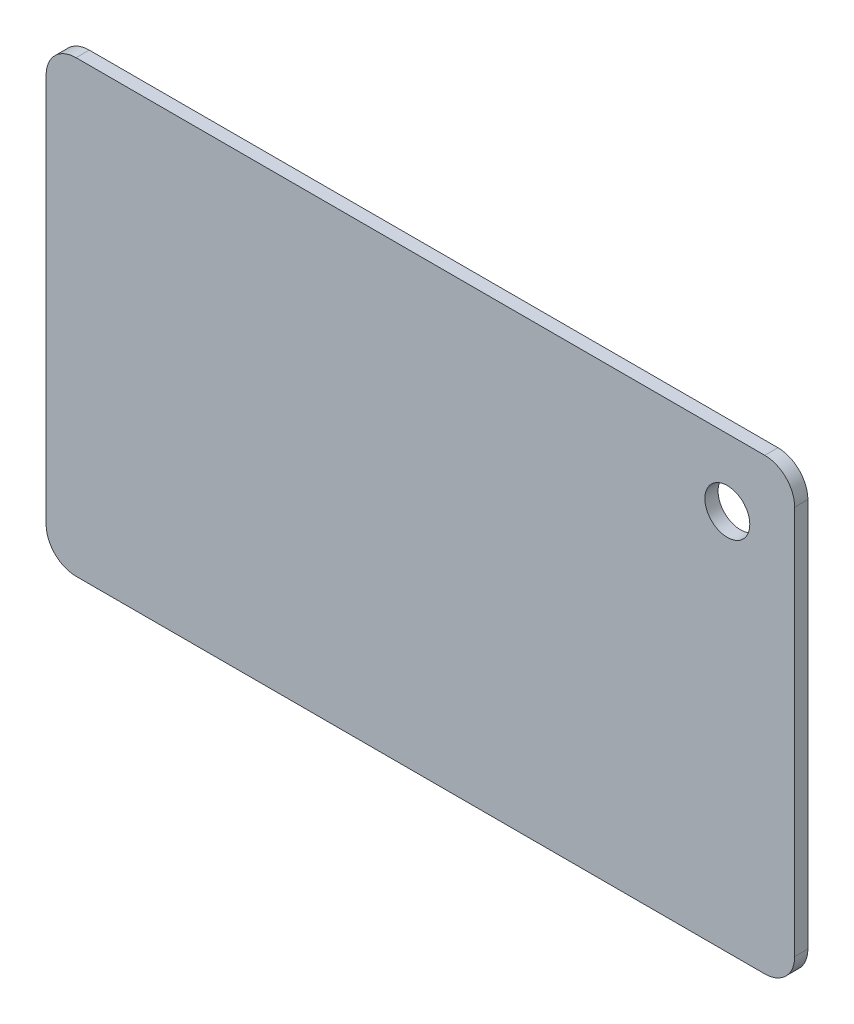
ISO-10303-21;
HEADER;
FILE_DESCRIPTION(('STEP AP214'),'2;1');
FILE_NAME('part.step','',(''),(''),'','','');
FILE_SCHEMA(('AUTOMOTIVE_DESIGN { 1 0 10303 214 1 1 1 1 }'));
ENDSEC;
DATA;
#1=APPLICATION_CONTEXT('core data for automotive mechanical design processes');
#2=APPLICATION_PROTOCOL_DEFINITION('international standard','automotive_design',2000,#1);
#3=PRODUCT_CONTEXT('',#1,'mechanical');
#4=PRODUCT('Part','Part','',(#3));
#5=PRODUCT_RELATED_PRODUCT_CATEGORY('part','',(#4));
#6=PRODUCT_DEFINITION_FORMATION('','',#4);
#7=PRODUCT_DEFINITION_CONTEXT('part definition',#1,'design');
#8=PRODUCT_DEFINITION('design','',#6,#7);
#9=PRODUCT_DEFINITION_SHAPE('','',#8);
#10=(LENGTH_UNIT() NAMED_UNIT(*) SI_UNIT(.MILLI.,.METRE.));
#11=(NAMED_UNIT(*) PLANE_ANGLE_UNIT() SI_UNIT($,.RADIAN.));
#12=(NAMED_UNIT(*) SI_UNIT($,.STERADIAN.) SOLID_ANGLE_UNIT());
#13=UNCERTAINTY_MEASURE_WITH_UNIT(LENGTH_MEASURE(1.E-05),#10,'distance_accuracy_value','');
#14=(GEOMETRIC_REPRESENTATION_CONTEXT(3) GLOBAL_UNCERTAINTY_ASSIGNED_CONTEXT((#13)) GLOBAL_UNIT_ASSIGNED_CONTEXT((#10,
#11,#12)) REPRESENTATION_CONTEXT('',''));
#15=CARTESIAN_POINT('',(0.,0.,0.));
#16=DIRECTION('',(0.,0.,1.));
#17=DIRECTION('',(1.,0.,0.));
#18=AXIS2_PLACEMENT_3D('',#15,#16,#17);
#19=CARTESIAN_POINT('',(23.,13.,0.88));
#20=DIRECTION('',(0.,0.,-1.));
#21=DIRECTION('',(-1.,0.,0.));
#22=AXIS2_PLACEMENT_3D('',#19,#20,#21);
#23=PLANE('',#22);
#24=CARTESIAN_POINT('',(23.,13.,0.88));
#25=DIRECTION('',(0.,0.,1.));
#26=DIRECTION('',(-1.,0.,0.));
#27=AXIS2_PLACEMENT_3D('',#24,#25,#26);
#28=CIRCLE('',#27,2.);
#29=CARTESIAN_POINT('',(25.,13.,0.88));
#30=VERTEX_POINT('',#29);
#31=CARTESIAN_POINT('',(23.,15.,0.88));
#32=VERTEX_POINT('',#31);
#33=EDGE_CURVE('E145',#30,#32,#28,.T.);
#34=ORIENTED_EDGE('',*,*,#33,.T.);
#35=DIRECTION('',(-1.,0.,0.));
#36=VECTOR('',#35,1.);
#37=CARTESIAN_POINT('',(23.,15.,0.88));
#38=LINE('',#37,#36);
#39=CARTESIAN_POINT('',(-23.,15.,0.88));
#40=VERTEX_POINT('',#39);
#41=EDGE_CURVE('E93',#32,#40,#38,.T.);
#42=ORIENTED_EDGE('',*,*,#41,.T.);
#43=CARTESIAN_POINT('',(-23.,13.,0.88));
#44=DIRECTION('',(0.,0.,1.));
#45=DIRECTION('',(1.,0.,0.));
#46=AXIS2_PLACEMENT_3D('',#43,#44,#45);
#47=CIRCLE('',#46,2.);
#48=CARTESIAN_POINT('',(-25.,13.,0.88));
#49=VERTEX_POINT('',#48);
#50=EDGE_CURVE('E160',#40,#49,#47,.T.);
#51=ORIENTED_EDGE('',*,*,#50,.T.);
#52=DIRECTION('',(0.,-1.,0.));
#53=VECTOR('',#52,1.);
#54=CARTESIAN_POINT('',(-25.,13.,0.88));
#55=LINE('',#54,#53);
#56=CARTESIAN_POINT('',(-25.,-13.,0.88));
#57=VERTEX_POINT('',#56);
#58=EDGE_CURVE('E173',#49,#57,#55,.T.);
#59=ORIENTED_EDGE('',*,*,#58,.T.);
#60=CARTESIAN_POINT('',(-23.,-13.,0.88));
#61=DIRECTION('',(0.,0.,1.));
#62=DIRECTION('',(-1.,0.,0.));
#63=AXIS2_PLACEMENT_3D('',#60,#61,#62);
#64=CIRCLE('',#63,2.);
#65=CARTESIAN_POINT('',(-23.,-15.,0.88));
#66=VERTEX_POINT('',#65);
#67=EDGE_CURVE('E112',#57,#66,#64,.T.);
#68=ORIENTED_EDGE('',*,*,#67,.T.);
#69=DIRECTION('',(1.,0.,0.));
#70=VECTOR('',#69,1.);
#71=CARTESIAN_POINT('',(23.,-15.,0.88));
#72=LINE('',#71,#70);
#73=CARTESIAN_POINT('',(23.,-15.,0.88));
#74=VERTEX_POINT('',#73);
#75=EDGE_CURVE('E106',#66,#74,#72,.T.);
#76=ORIENTED_EDGE('',*,*,#75,.T.);
#77=CARTESIAN_POINT('',(23.,-13.,0.88));
#78=DIRECTION('',(0.,0.,1.));
#79=DIRECTION('',(-1.,0.,0.));
#80=AXIS2_PLACEMENT_3D('',#77,#78,#79);
#81=CIRCLE('',#80,2.);
#82=CARTESIAN_POINT('',(25.,-13.,0.88));
#83=VERTEX_POINT('',#82);
#84=EDGE_CURVE('E110',#74,#83,#81,.T.);
#85=ORIENTED_EDGE('',*,*,#84,.T.);
#86=DIRECTION('',(0.,1.,0.));
#87=VECTOR('',#86,1.);
#88=CARTESIAN_POINT('',(25.,13.,0.88));
#89=LINE('',#88,#87);
#90=EDGE_CURVE('E50',#83,#30,#89,.T.);
#91=ORIENTED_EDGE('',*,*,#90,.T.);
#92=EDGE_LOOP('',(#34,#42,#51,#59,#68,#76,#85,#91));
#93=FACE_BOUND('',#92,.T.);
#94=CARTESIAN_POINT('',(20.5,10.5,0.88));
#95=DIRECTION('',(0.,0.,1.));
#96=DIRECTION('',(1.,0.,0.));
#97=AXIS2_PLACEMENT_3D('',#94,#95,#96);
#98=CIRCLE('',#97,1.5);
#99=CARTESIAN_POINT('',(22.,10.5,0.88));
#100=VERTEX_POINT('',#99);
#101=EDGE_CURVE('E134',#100,#100,#98,.T.);
#102=ORIENTED_EDGE('',*,*,#101,.F.);
#103=EDGE_LOOP('',(#102));
#104=FACE_BOUND('',#103,.T.);
#105=ADVANCED_FACE('F33',(#93,#104),#23,.F.);
#106=CARTESIAN_POINT('',(23.,13.,0.));
#107=DIRECTION('',(0.,0.,-1.));
#108=DIRECTION('',(-1.,0.,0.));
#109=AXIS2_PLACEMENT_3D('',#106,#107,#108);
#110=PLANE('',#109);
#111=CARTESIAN_POINT('',(23.,13.,0.));
#112=DIRECTION('',(0.,0.,1.));
#113=DIRECTION('',(-1.,0.,0.));
#114=AXIS2_PLACEMENT_3D('',#111,#112,#113);
#115=CIRCLE('',#114,2.);
#116=CARTESIAN_POINT('',(25.,13.,0.));
#117=VERTEX_POINT('',#116);
#118=CARTESIAN_POINT('',(23.,15.,0.));
#119=VERTEX_POINT('',#118);
#120=EDGE_CURVE('E130',#117,#119,#115,.T.);
#121=ORIENTED_EDGE('',*,*,#120,.F.);
#122=DIRECTION('',(0.,1.,0.));
#123=VECTOR('',#122,1.);
#124=CARTESIAN_POINT('',(25.,13.,0.));
#125=LINE('',#124,#123);
#126=CARTESIAN_POINT('',(25.,-13.,0.));
#127=VERTEX_POINT('',#126);
#128=EDGE_CURVE('E85',#127,#117,#125,.T.);
#129=ORIENTED_EDGE('',*,*,#128,.F.);
#130=CARTESIAN_POINT('',(23.,-13.,0.));
#131=DIRECTION('',(0.,0.,1.));
#132=DIRECTION('',(-1.,0.,0.));
#133=AXIS2_PLACEMENT_3D('',#130,#131,#132);
#134=CIRCLE('',#133,2.);
#135=CARTESIAN_POINT('',(23.,-15.,0.));
#136=VERTEX_POINT('',#135);
#137=EDGE_CURVE('E79',#136,#127,#134,.T.);
#138=ORIENTED_EDGE('',*,*,#137,.F.);
#139=DIRECTION('',(1.,0.,0.));
#140=VECTOR('',#139,1.);
#141=CARTESIAN_POINT('',(23.,-15.,0.));
#142=LINE('',#141,#140);
#143=CARTESIAN_POINT('',(-23.,-15.,0.));
#144=VERTEX_POINT('',#143);
#145=EDGE_CURVE('E120',#144,#136,#142,.T.);
#146=ORIENTED_EDGE('',*,*,#145,.F.);
#147=CARTESIAN_POINT('',(-23.,-13.,0.));
#148=DIRECTION('',(0.,0.,1.));
#149=DIRECTION('',(-1.,0.,0.));
#150=AXIS2_PLACEMENT_3D('',#147,#148,#149);
#151=CIRCLE('',#150,2.);
#152=CARTESIAN_POINT('',(-25.,-13.,0.));
#153=VERTEX_POINT('',#152);
#154=EDGE_CURVE('E140',#153,#144,#151,.T.);
#155=ORIENTED_EDGE('',*,*,#154,.F.);
#156=DIRECTION('',(0.,-1.,0.));
#157=VECTOR('',#156,1.);
#158=CARTESIAN_POINT('',(-25.,13.,0.));
#159=LINE('',#158,#157);
#160=CARTESIAN_POINT('',(-25.,13.,0.));
#161=VERTEX_POINT('',#160);
#162=EDGE_CURVE('E138',#161,#153,#159,.T.);
#163=ORIENTED_EDGE('',*,*,#162,.F.);
#164=CARTESIAN_POINT('',(-23.,13.,0.));
#165=DIRECTION('',(0.,0.,1.));
#166=DIRECTION('',(1.,0.,0.));
#167=AXIS2_PLACEMENT_3D('',#164,#165,#166);
#168=CIRCLE('',#167,2.);
#169=CARTESIAN_POINT('',(-23.,15.,0.));
#170=VERTEX_POINT('',#169);
#171=EDGE_CURVE('E136',#170,#161,#168,.T.);
#172=ORIENTED_EDGE('',*,*,#171,.F.);
#173=DIRECTION('',(-1.,0.,0.));
#174=VECTOR('',#173,1.);
#175=CARTESIAN_POINT('',(23.,15.,0.));
#176=LINE('',#175,#174);
#177=EDGE_CURVE('E133',#119,#170,#176,.T.);
#178=ORIENTED_EDGE('',*,*,#177,.F.);
#179=EDGE_LOOP('',(#121,#129,#138,#146,#155,#163,#172,#178));
#180=FACE_BOUND('',#179,.T.);
#181=CARTESIAN_POINT('',(20.5,10.5,0.));
#182=DIRECTION('',(0.,0.,1.));
#183=DIRECTION('',(1.,0.,0.));
#184=AXIS2_PLACEMENT_3D('',#181,#182,#183);
#185=CIRCLE('',#184,1.5);
#186=CARTESIAN_POINT('',(22.,10.5,0.));
#187=VERTEX_POINT('',#186);
#188=EDGE_CURVE('E179',#187,#187,#185,.T.);
#189=ORIENTED_EDGE('',*,*,#188,.T.);
#190=EDGE_LOOP('',(#189));
#191=FACE_BOUND('',#190,.T.);
#192=ADVANCED_FACE('F164',(#180,#191),#110,.T.);
#193=CARTESIAN_POINT('',(23.,13.,0.88));
#194=DIRECTION('',(0.,0.,-1.));
#195=DIRECTION('',(-1.,0.,0.));
#196=AXIS2_PLACEMENT_3D('',#193,#194,#195);
#197=CYLINDRICAL_SURFACE('',#196,2.);
#198=ORIENTED_EDGE('',*,*,#120,.T.);
#199=DIRECTION('',(0.,0.,-1.));
#200=VECTOR('',#199,1.);
#201=CARTESIAN_POINT('',(23.,15.,0.88));
#202=LINE('',#201,#200);
#203=EDGE_CURVE('E11',#32,#119,#202,.T.);
#204=ORIENTED_EDGE('',*,*,#203,.F.);
#205=ORIENTED_EDGE('',*,*,#33,.F.);
#206=DIRECTION('',(0.,0.,-1.));
#207=VECTOR('',#206,1.);
#208=CARTESIAN_POINT('',(25.,13.,0.88));
#209=LINE('',#208,#207);
#210=EDGE_CURVE('E126',#30,#117,#209,.T.);
#211=ORIENTED_EDGE('',*,*,#210,.T.);
#212=EDGE_LOOP('',(#198,#204,#205,#211));
#213=FACE_BOUND('',#212,.T.);
#214=ADVANCED_FACE('F35',(#213),#197,.T.);
#215=CARTESIAN_POINT('',(23.,15.,0.88));
#216=DIRECTION('',(0.,-1.,0.));
#217=DIRECTION('',(0.,0.,-1.));
#218=AXIS2_PLACEMENT_3D('',#215,#216,#217);
#219=PLANE('',#218);
#220=ORIENTED_EDGE('',*,*,#177,.T.);
#221=DIRECTION('',(0.,0.,-1.));
#222=VECTOR('',#221,1.);
#223=CARTESIAN_POINT('',(-23.,15.,0.88));
#224=LINE('',#223,#222);
#225=EDGE_CURVE('E42',#40,#170,#224,.T.);
#226=ORIENTED_EDGE('',*,*,#225,.F.);
#227=ORIENTED_EDGE('',*,*,#41,.F.);
#228=ORIENTED_EDGE('',*,*,#203,.T.);
#229=EDGE_LOOP('',(#220,#226,#227,#228));
#230=FACE_BOUND('',#229,.T.);
#231=ADVANCED_FACE('F207',(#230),#219,.F.);
#232=CARTESIAN_POINT('',(-23.,13.,0.88));
#233=DIRECTION('',(0.,0.,-1.));
#234=DIRECTION('',(-1.,0.,0.));
#235=AXIS2_PLACEMENT_3D('',#232,#233,#234);
#236=CYLINDRICAL_SURFACE('',#235,2.);
#237=ORIENTED_EDGE('',*,*,#171,.T.);
#238=DIRECTION('',(0.,0.,-1.));
#239=VECTOR('',#238,1.);
#240=CARTESIAN_POINT('',(-25.,13.,0.88));
#241=LINE('',#240,#239);
#242=EDGE_CURVE('E152',#49,#161,#241,.T.);
#243=ORIENTED_EDGE('',*,*,#242,.F.);
#244=ORIENTED_EDGE('',*,*,#50,.F.);
#245=ORIENTED_EDGE('',*,*,#225,.T.);
#246=EDGE_LOOP('',(#237,#243,#244,#245));
#247=FACE_BOUND('',#246,.T.);
#248=ADVANCED_FACE('F158',(#247),#236,.T.);
#249=CARTESIAN_POINT('',(-25.,13.,0.88));
#250=DIRECTION('',(1.,0.,0.));
#251=DIRECTION('',(0.,0.,-1.));
#252=AXIS2_PLACEMENT_3D('',#249,#250,#251);
#253=PLANE('',#252);
#254=ORIENTED_EDGE('',*,*,#162,.T.);
#255=DIRECTION('',(0.,0.,-1.));
#256=VECTOR('',#255,1.);
#257=CARTESIAN_POINT('',(-25.,-13.,0.88));
#258=LINE('',#257,#256);
#259=EDGE_CURVE('E149',#57,#153,#258,.T.);
#260=ORIENTED_EDGE('',*,*,#259,.F.);
#261=ORIENTED_EDGE('',*,*,#58,.F.);
#262=ORIENTED_EDGE('',*,*,#242,.T.);
#263=EDGE_LOOP('',(#254,#260,#261,#262));
#264=FACE_BOUND('',#263,.T.);
#265=ADVANCED_FACE('F169',(#264),#253,.F.);
#266=CARTESIAN_POINT('',(-23.,-13.,0.88));
#267=DIRECTION('',(0.,0.,-1.));
#268=DIRECTION('',(-1.,0.,0.));
#269=AXIS2_PLACEMENT_3D('',#266,#267,#268);
#270=CYLINDRICAL_SURFACE('',#269,2.);
#271=ORIENTED_EDGE('',*,*,#154,.T.);
#272=DIRECTION('',(0.,0.,-1.));
#273=VECTOR('',#272,1.);
#274=CARTESIAN_POINT('',(-23.,-15.,0.88));
#275=LINE('',#274,#273);
#276=EDGE_CURVE('E121',#66,#144,#275,.T.);
#277=ORIENTED_EDGE('',*,*,#276,.F.);
#278=ORIENTED_EDGE('',*,*,#67,.F.);
#279=ORIENTED_EDGE('',*,*,#259,.T.);
#280=EDGE_LOOP('',(#271,#277,#278,#279));
#281=FACE_BOUND('',#280,.T.);
#282=ADVANCED_FACE('F172',(#281),#270,.T.);
#283=CARTESIAN_POINT('',(23.,-15.,0.88));
#284=DIRECTION('',(0.,1.,0.));
#285=DIRECTION('',(0.,0.,1.));
#286=AXIS2_PLACEMENT_3D('',#283,#284,#285);
#287=PLANE('',#286);
#288=ORIENTED_EDGE('',*,*,#145,.T.);
#289=DIRECTION('',(0.,0.,-1.));
#290=VECTOR('',#289,1.);
#291=CARTESIAN_POINT('',(23.,-15.,0.88));
#292=LINE('',#291,#290);
#293=EDGE_CURVE('E117',#74,#136,#292,.T.);
#294=ORIENTED_EDGE('',*,*,#293,.F.);
#295=ORIENTED_EDGE('',*,*,#75,.F.);
#296=ORIENTED_EDGE('',*,*,#276,.T.);
#297=EDGE_LOOP('',(#288,#294,#295,#296));
#298=FACE_BOUND('',#297,.T.);
#299=ADVANCED_FACE('F118',(#298),#287,.F.);
#300=CARTESIAN_POINT('',(23.,-13.,0.88));
#301=DIRECTION('',(0.,0.,-1.));
#302=DIRECTION('',(-1.,0.,0.));
#303=AXIS2_PLACEMENT_3D('',#300,#301,#302);
#304=CYLINDRICAL_SURFACE('',#303,2.);
#305=ORIENTED_EDGE('',*,*,#137,.T.);
#306=DIRECTION('',(0.,0.,-1.));
#307=VECTOR('',#306,1.);
#308=CARTESIAN_POINT('',(25.,-13.,0.88));
#309=LINE('',#308,#307);
#310=EDGE_CURVE('E122',#83,#127,#309,.T.);
#311=ORIENTED_EDGE('',*,*,#310,.F.);
#312=ORIENTED_EDGE('',*,*,#84,.F.);
#313=ORIENTED_EDGE('',*,*,#293,.T.);
#314=EDGE_LOOP('',(#305,#311,#312,#313));
#315=FACE_BOUND('',#314,.T.);
#316=ADVANCED_FACE('F124',(#315),#304,.T.);
#317=CARTESIAN_POINT('',(25.,13.,0.88));
#318=DIRECTION('',(-1.,0.,0.));
#319=DIRECTION('',(0.,0.,1.));
#320=AXIS2_PLACEMENT_3D('',#317,#318,#319);
#321=PLANE('',#320);
#322=ORIENTED_EDGE('',*,*,#128,.T.);
#323=ORIENTED_EDGE('',*,*,#210,.F.);
#324=ORIENTED_EDGE('',*,*,#90,.F.);
#325=ORIENTED_EDGE('',*,*,#310,.T.);
#326=EDGE_LOOP('',(#322,#323,#324,#325));
#327=FACE_BOUND('',#326,.T.);
#328=ADVANCED_FACE('F195',(#327),#321,.F.);
#329=CARTESIAN_POINT('',(20.5,10.5,0.88));
#330=DIRECTION('',(0.,0.,-1.));
#331=DIRECTION('',(-1.,0.,0.));
#332=AXIS2_PLACEMENT_3D('',#329,#330,#331);
#333=CYLINDRICAL_SURFACE('',#332,1.5);
#334=ORIENTED_EDGE('',*,*,#101,.T.);
#335=EDGE_LOOP('',(#334));
#336=FACE_BOUND('',#335,.T.);
#337=ORIENTED_EDGE('',*,*,#188,.F.);
#338=EDGE_LOOP('',(#337));
#339=FACE_BOUND('',#338,.T.);
#340=ADVANCED_FACE('F185',(#336,#339),#333,.F.);
#341=CLOSED_SHELL('',(#105,#192,#214,#231,#248,#265,#282,#299,#316,#328,#340));
#342=MANIFOLD_SOLID_BREP('B2',#341);
#343=ADVANCED_BREP_SHAPE_REPRESENTATION('',(#18,#342),#14);
#344=SHAPE_DEFINITION_REPRESENTATION(#9,#343);
ENDSEC;
END-ISO-10303-21;
